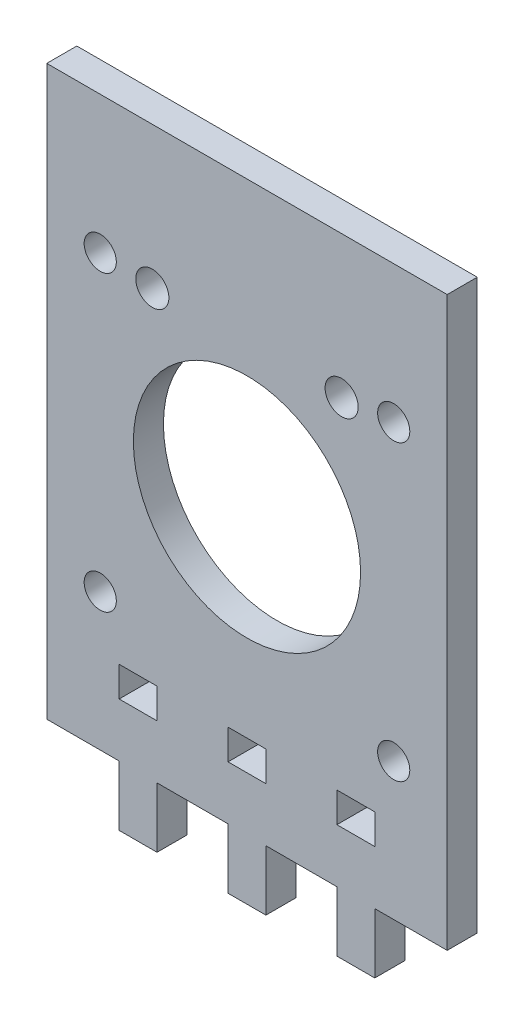
ISO-10303-21;
HEADER;
FILE_DESCRIPTION(('STEP AP214'),'2;1');
FILE_NAME('part.step','',(''),(''),'','','');
FILE_SCHEMA(('AUTOMOTIVE_DESIGN { 1 0 10303 214 1 1 1 1 }'));
ENDSEC;
DATA;
#1=APPLICATION_CONTEXT('core data for automotive mechanical design processes');
#2=APPLICATION_PROTOCOL_DEFINITION('international standard','automotive_design',2000,#1);
#3=PRODUCT_CONTEXT('',#1,'mechanical');
#4=PRODUCT('Part','Part','',(#3));
#5=PRODUCT_RELATED_PRODUCT_CATEGORY('part','',(#4));
#6=PRODUCT_DEFINITION_FORMATION('','',#4);
#7=PRODUCT_DEFINITION_CONTEXT('part definition',#1,'design');
#8=PRODUCT_DEFINITION('design','',#6,#7);
#9=PRODUCT_DEFINITION_SHAPE('','',#8);
#10=(LENGTH_UNIT() NAMED_UNIT(*) SI_UNIT(.MILLI.,.METRE.));
#11=(NAMED_UNIT(*) PLANE_ANGLE_UNIT() SI_UNIT($,.RADIAN.));
#12=(NAMED_UNIT(*) SI_UNIT($,.STERADIAN.) SOLID_ANGLE_UNIT());
#13=UNCERTAINTY_MEASURE_WITH_UNIT(LENGTH_MEASURE(1.E-05),#10,'distance_accuracy_value','');
#14=(GEOMETRIC_REPRESENTATION_CONTEXT(3) GLOBAL_UNCERTAINTY_ASSIGNED_CONTEXT((#13)) GLOBAL_UNIT_ASSIGNED_CONTEXT((#10,
#11,#12)) REPRESENTATION_CONTEXT('',''));
#15=CARTESIAN_POINT('',(0.,0.,0.));
#16=DIRECTION('',(0.,0.,1.));
#17=DIRECTION('',(1.,0.,0.));
#18=AXIS2_PLACEMENT_3D('',#15,#16,#17);
#19=CARTESIAN_POINT('',(13.4999999999999,0.,3.175));
#20=DIRECTION('',(-1.,0.,0.));
#21=DIRECTION('',(0.,0.,1.));
#22=AXIS2_PLACEMENT_3D('',#19,#20,#21);
#23=PLANE('',#22);
#24=DIRECTION('',(0.,1.,0.));
#25=VECTOR('',#24,1.);
#26=CARTESIAN_POINT('',(13.4999999999999,0.,0.));
#27=LINE('',#26,#25);
#28=CARTESIAN_POINT('',(13.4999999999999,-24.325,0.));
#29=VERTEX_POINT('',#28);
#30=CARTESIAN_POINT('',(13.4999999999999,-21.15,0.));
#31=VERTEX_POINT('',#30);
#32=EDGE_CURVE('E306',#29,#31,#27,.T.);
#33=ORIENTED_EDGE('',*,*,#32,.F.);
#34=DIRECTION('',(0.,0.,-1.));
#35=VECTOR('',#34,1.);
#36=CARTESIAN_POINT('',(13.4999999999999,-24.325,3.175));
#37=LINE('',#36,#35);
#38=CARTESIAN_POINT('',(13.4999999999999,-24.325,3.175));
#39=VERTEX_POINT('',#38);
#40=EDGE_CURVE('E11',#39,#29,#37,.T.);
#41=ORIENTED_EDGE('',*,*,#40,.F.);
#42=DIRECTION('',(0.,1.,0.));
#43=VECTOR('',#42,1.);
#44=CARTESIAN_POINT('',(13.4999999999999,0.,3.175));
#45=LINE('',#44,#43);
#46=CARTESIAN_POINT('',(13.4999999999999,-21.15,3.175));
#47=VERTEX_POINT('',#46);
#48=EDGE_CURVE('E220',#39,#47,#45,.T.);
#49=ORIENTED_EDGE('',*,*,#48,.T.);
#50=DIRECTION('',(0.,0.,-1.));
#51=VECTOR('',#50,1.);
#52=CARTESIAN_POINT('',(13.4999999999999,-21.15,3.175));
#53=LINE('',#52,#51);
#54=EDGE_CURVE('E136',#47,#31,#53,.T.);
#55=ORIENTED_EDGE('',*,*,#54,.T.);
#56=EDGE_LOOP('',(#33,#41,#49,#55));
#57=FACE_BOUND('',#56,.T.);
#58=ADVANCED_FACE('F39',(#57),#23,.T.);
#59=CARTESIAN_POINT('',(0.,-24.325,3.175));
#60=DIRECTION('',(0.,1.,0.));
#61=DIRECTION('',(-1.,0.,0.));
#62=AXIS2_PLACEMENT_3D('',#59,#60,#61);
#63=PLANE('',#62);
#64=DIRECTION('',(1.,0.,0.));
#65=VECTOR('',#64,1.);
#66=CARTESIAN_POINT('',(0.,-24.325,0.));
#67=LINE('',#66,#65);
#68=CARTESIAN_POINT('',(9.49999999999998,-24.325,0.));
#69=VERTEX_POINT('',#68);
#70=EDGE_CURVE('E209',#69,#29,#67,.T.);
#71=ORIENTED_EDGE('',*,*,#70,.F.);
#72=DIRECTION('',(0.,0.,-1.));
#73=VECTOR('',#72,1.);
#74=CARTESIAN_POINT('',(9.49999999999998,-24.325,3.175));
#75=LINE('',#74,#73);
#76=CARTESIAN_POINT('',(9.49999999999998,-24.325,3.175));
#77=VERTEX_POINT('',#76);
#78=EDGE_CURVE('E49',#77,#69,#75,.T.);
#79=ORIENTED_EDGE('',*,*,#78,.F.);
#80=DIRECTION('',(1.,0.,0.));
#81=VECTOR('',#80,1.);
#82=CARTESIAN_POINT('',(0.,-24.325,3.175));
#83=LINE('',#82,#81);
#84=EDGE_CURVE('E207',#77,#39,#83,.T.);
#85=ORIENTED_EDGE('',*,*,#84,.T.);
#86=ORIENTED_EDGE('',*,*,#40,.T.);
#87=EDGE_LOOP('',(#71,#79,#85,#86));
#88=FACE_BOUND('',#87,.T.);
#89=ADVANCED_FACE('F205',(#88),#63,.T.);
#90=CARTESIAN_POINT('',(9.49999999999994,0.,3.175));
#91=DIRECTION('',(-1.,0.,0.));
#92=DIRECTION('',(0.,0.,1.));
#93=AXIS2_PLACEMENT_3D('',#90,#91,#92);
#94=PLANE('',#93);
#95=DIRECTION('',(0.,1.,0.));
#96=VECTOR('',#95,1.);
#97=CARTESIAN_POINT('',(9.49999999999994,0.,0.));
#98=LINE('',#97,#96);
#99=CARTESIAN_POINT('',(9.49999999999994,-21.15,0.));
#100=VERTEX_POINT('',#99);
#101=EDGE_CURVE('E309',#69,#100,#98,.T.);
#102=ORIENTED_EDGE('',*,*,#101,.T.);
#103=DIRECTION('',(0.,0.,-1.));
#104=VECTOR('',#103,1.);
#105=CARTESIAN_POINT('',(9.49999999999994,-21.15,3.175));
#106=LINE('',#105,#104);
#107=CARTESIAN_POINT('',(9.49999999999994,-21.15,3.175));
#108=VERTEX_POINT('',#107);
#109=EDGE_CURVE('E212',#108,#100,#106,.T.);
#110=ORIENTED_EDGE('',*,*,#109,.F.);
#111=DIRECTION('',(0.,1.,0.));
#112=VECTOR('',#111,1.);
#113=CARTESIAN_POINT('',(9.49999999999994,0.,3.175));
#114=LINE('',#113,#112);
#115=EDGE_CURVE('E215',#77,#108,#114,.T.);
#116=ORIENTED_EDGE('',*,*,#115,.F.);
#117=ORIENTED_EDGE('',*,*,#78,.T.);
#118=EDGE_LOOP('',(#102,#110,#116,#117));
#119=FACE_BOUND('',#118,.T.);
#120=ADVANCED_FACE('F216',(#119),#94,.F.);
#121=CARTESIAN_POINT('',(1.99999999999994,0.,3.175));
#122=DIRECTION('',(-1.,0.,0.));
#123=DIRECTION('',(0.,0.,1.));
#124=AXIS2_PLACEMENT_3D('',#121,#122,#123);
#125=PLANE('',#124);
#126=DIRECTION('',(0.,1.,0.));
#127=VECTOR('',#126,1.);
#128=CARTESIAN_POINT('',(1.99999999999994,0.,0.));
#129=LINE('',#128,#127);
#130=CARTESIAN_POINT('',(1.9999999999999,-24.325,0.));
#131=VERTEX_POINT('',#130);
#132=CARTESIAN_POINT('',(1.99999999999994,-21.15,0.));
#133=VERTEX_POINT('',#132);
#134=EDGE_CURVE('E294',#131,#133,#129,.T.);
#135=ORIENTED_EDGE('',*,*,#134,.F.);
#136=DIRECTION('',(0.,0.,-1.));
#137=VECTOR('',#136,1.);
#138=CARTESIAN_POINT('',(1.9999999999999,-24.325,3.175));
#139=LINE('',#138,#137);
#140=CARTESIAN_POINT('',(1.9999999999999,-24.325,3.175));
#141=VERTEX_POINT('',#140);
#142=EDGE_CURVE('E335',#141,#131,#139,.T.);
#143=ORIENTED_EDGE('',*,*,#142,.F.);
#144=DIRECTION('',(0.,1.,0.));
#145=VECTOR('',#144,1.);
#146=CARTESIAN_POINT('',(1.99999999999994,0.,3.175));
#147=LINE('',#146,#145);
#148=CARTESIAN_POINT('',(1.99999999999994,-21.15,3.175));
#149=VERTEX_POINT('',#148);
#150=EDGE_CURVE('E469',#141,#149,#147,.T.);
#151=ORIENTED_EDGE('',*,*,#150,.T.);
#152=DIRECTION('',(0.,0.,-1.));
#153=VECTOR('',#152,1.);
#154=CARTESIAN_POINT('',(1.99999999999994,-21.15,3.175));
#155=LINE('',#154,#153);
#156=EDGE_CURVE('E337',#149,#133,#155,.T.);
#157=ORIENTED_EDGE('',*,*,#156,.T.);
#158=EDGE_LOOP('',(#135,#143,#151,#157));
#159=FACE_BOUND('',#158,.T.);
#160=ADVANCED_FACE('F487',(#159),#125,.T.);
#161=CARTESIAN_POINT('',(0.,-24.325,3.175));
#162=DIRECTION('',(0.,1.,0.));
#163=DIRECTION('',(0.,0.,1.));
#164=AXIS2_PLACEMENT_3D('',#161,#162,#163);
#165=PLANE('',#164);
#166=DIRECTION('',(1.,0.,0.));
#167=VECTOR('',#166,1.);
#168=CARTESIAN_POINT('',(0.,-24.325,0.));
#169=LINE('',#168,#167);
#170=CARTESIAN_POINT('',(-2.0000000000001,-24.325,0.));
#171=VERTEX_POINT('',#170);
#172=EDGE_CURVE('E297',#171,#131,#169,.T.);
#173=ORIENTED_EDGE('',*,*,#172,.F.);
#174=DIRECTION('',(0.,0.,-1.));
#175=VECTOR('',#174,1.);
#176=CARTESIAN_POINT('',(-2.0000000000001,-24.325,3.175));
#177=LINE('',#176,#175);
#178=CARTESIAN_POINT('',(-2.0000000000001,-24.325,3.175));
#179=VERTEX_POINT('',#178);
#180=EDGE_CURVE('E343',#179,#171,#177,.T.);
#181=ORIENTED_EDGE('',*,*,#180,.F.);
#182=DIRECTION('',(1.,0.,0.));
#183=VECTOR('',#182,1.);
#184=CARTESIAN_POINT('',(0.,-24.325,3.175));
#185=LINE('',#184,#183);
#186=EDGE_CURVE('E472',#179,#141,#185,.T.);
#187=ORIENTED_EDGE('',*,*,#186,.T.);
#188=ORIENTED_EDGE('',*,*,#142,.T.);
#189=EDGE_LOOP('',(#173,#181,#187,#188));
#190=FACE_BOUND('',#189,.T.);
#191=ADVANCED_FACE('F490',(#190),#165,.T.);
#192=CARTESIAN_POINT('',(-2.00000000000006,0.,3.175));
#193=DIRECTION('',(-1.,0.,0.));
#194=DIRECTION('',(0.,0.,1.));
#195=AXIS2_PLACEMENT_3D('',#192,#193,#194);
#196=PLANE('',#195);
#197=DIRECTION('',(0.,1.,0.));
#198=VECTOR('',#197,1.);
#199=CARTESIAN_POINT('',(-2.00000000000006,0.,0.));
#200=LINE('',#199,#198);
#201=CARTESIAN_POINT('',(-2.00000000000006,-21.15,0.));
#202=VERTEX_POINT('',#201);
#203=EDGE_CURVE('E300',#171,#202,#200,.T.);
#204=ORIENTED_EDGE('',*,*,#203,.T.);
#205=DIRECTION('',(0.,0.,-1.));
#206=VECTOR('',#205,1.);
#207=CARTESIAN_POINT('',(-2.00000000000006,-21.15,3.175));
#208=LINE('',#207,#206);
#209=CARTESIAN_POINT('',(-2.00000000000006,-21.15,3.175));
#210=VERTEX_POINT('',#209);
#211=EDGE_CURVE('E339',#210,#202,#208,.T.);
#212=ORIENTED_EDGE('',*,*,#211,.F.);
#213=DIRECTION('',(0.,1.,0.));
#214=VECTOR('',#213,1.);
#215=CARTESIAN_POINT('',(-2.00000000000006,0.,3.175));
#216=LINE('',#215,#214);
#217=EDGE_CURVE('E475',#179,#210,#216,.T.);
#218=ORIENTED_EDGE('',*,*,#217,.F.);
#219=ORIENTED_EDGE('',*,*,#180,.T.);
#220=EDGE_LOOP('',(#204,#212,#218,#219));
#221=FACE_BOUND('',#220,.T.);
#222=ADVANCED_FACE('F493',(#221),#196,.F.);
#223=CARTESIAN_POINT('',(-9.50000000000006,0.,3.175));
#224=DIRECTION('',(-1.,0.,0.));
#225=DIRECTION('',(0.,0.,1.));
#226=AXIS2_PLACEMENT_3D('',#223,#224,#225);
#227=PLANE('',#226);
#228=DIRECTION('',(0.,1.,0.));
#229=VECTOR('',#228,1.);
#230=CARTESIAN_POINT('',(-9.50000000000006,0.,0.));
#231=LINE('',#230,#229);
#232=CARTESIAN_POINT('',(-9.50000000000006,-24.325,0.));
#233=VERTEX_POINT('',#232);
#234=CARTESIAN_POINT('',(-9.50000000000006,-21.15,0.));
#235=VERTEX_POINT('',#234);
#236=EDGE_CURVE('E282',#233,#235,#231,.T.);
#237=ORIENTED_EDGE('',*,*,#236,.F.);
#238=DIRECTION('',(0.,0.,-1.));
#239=VECTOR('',#238,1.);
#240=CARTESIAN_POINT('',(-9.50000000000006,-24.325,3.175));
#241=LINE('',#240,#239);
#242=CARTESIAN_POINT('',(-9.50000000000006,-24.325,3.175));
#243=VERTEX_POINT('',#242);
#244=EDGE_CURVE('E340',#243,#233,#241,.T.);
#245=ORIENTED_EDGE('',*,*,#244,.F.);
#246=DIRECTION('',(0.,1.,0.));
#247=VECTOR('',#246,1.);
#248=CARTESIAN_POINT('',(-9.50000000000006,0.,3.175));
#249=LINE('',#248,#247);
#250=CARTESIAN_POINT('',(-9.50000000000006,-21.15,3.175));
#251=VERTEX_POINT('',#250);
#252=EDGE_CURVE('E458',#243,#251,#249,.T.);
#253=ORIENTED_EDGE('',*,*,#252,.T.);
#254=DIRECTION('',(0.,0.,-1.));
#255=VECTOR('',#254,1.);
#256=CARTESIAN_POINT('',(-9.50000000000006,-21.15,3.175));
#257=LINE('',#256,#255);
#258=EDGE_CURVE('E346',#251,#235,#257,.T.);
#259=ORIENTED_EDGE('',*,*,#258,.T.);
#260=EDGE_LOOP('',(#237,#245,#253,#259));
#261=FACE_BOUND('',#260,.T.);
#262=ADVANCED_FACE('F542',(#261),#227,.T.);
#263=CARTESIAN_POINT('',(0.,-24.325,3.175));
#264=DIRECTION('',(0.,1.,0.));
#265=DIRECTION('',(0.,0.,1.));
#266=AXIS2_PLACEMENT_3D('',#263,#264,#265);
#267=PLANE('',#266);
#268=DIRECTION('',(1.,0.,0.));
#269=VECTOR('',#268,1.);
#270=CARTESIAN_POINT('',(0.,-24.325,0.));
#271=LINE('',#270,#269);
#272=CARTESIAN_POINT('',(-13.5000000000001,-24.325,0.));
#273=VERTEX_POINT('',#272);
#274=EDGE_CURVE('E285',#273,#233,#271,.T.);
#275=ORIENTED_EDGE('',*,*,#274,.F.);
#276=DIRECTION('',(0.,0.,-1.));
#277=VECTOR('',#276,1.);
#278=CARTESIAN_POINT('',(-13.5000000000001,-24.325,3.175));
#279=LINE('',#278,#277);
#280=CARTESIAN_POINT('',(-13.5000000000001,-24.325,3.175));
#281=VERTEX_POINT('',#280);
#282=EDGE_CURVE('E351',#281,#273,#279,.T.);
#283=ORIENTED_EDGE('',*,*,#282,.F.);
#284=DIRECTION('',(1.,0.,0.));
#285=VECTOR('',#284,1.);
#286=CARTESIAN_POINT('',(0.,-24.325,3.175));
#287=LINE('',#286,#285);
#288=EDGE_CURVE('E461',#281,#243,#287,.T.);
#289=ORIENTED_EDGE('',*,*,#288,.T.);
#290=ORIENTED_EDGE('',*,*,#244,.T.);
#291=EDGE_LOOP('',(#275,#283,#289,#290));
#292=FACE_BOUND('',#291,.T.);
#293=ADVANCED_FACE('F553',(#292),#267,.T.);
#294=CARTESIAN_POINT('',(-13.5000000000001,0.,3.175));
#295=DIRECTION('',(-1.,0.,0.));
#296=DIRECTION('',(0.,0.,1.));
#297=AXIS2_PLACEMENT_3D('',#294,#295,#296);
#298=PLANE('',#297);
#299=DIRECTION('',(0.,1.,0.));
#300=VECTOR('',#299,1.);
#301=CARTESIAN_POINT('',(-13.5000000000001,0.,0.));
#302=LINE('',#301,#300);
#303=CARTESIAN_POINT('',(-13.5000000000001,-21.15,0.));
#304=VERTEX_POINT('',#303);
#305=EDGE_CURVE('E288',#273,#304,#302,.T.);
#306=ORIENTED_EDGE('',*,*,#305,.T.);
#307=DIRECTION('',(0.,0.,-1.));
#308=VECTOR('',#307,1.);
#309=CARTESIAN_POINT('',(-13.5000000000001,-21.15,3.175));
#310=LINE('',#309,#308);
#311=CARTESIAN_POINT('',(-13.5000000000001,-21.15,3.175));
#312=VERTEX_POINT('',#311);
#313=EDGE_CURVE('E348',#312,#304,#310,.T.);
#314=ORIENTED_EDGE('',*,*,#313,.F.);
#315=DIRECTION('',(0.,1.,0.));
#316=VECTOR('',#315,1.);
#317=CARTESIAN_POINT('',(-13.5000000000001,0.,3.175));
#318=LINE('',#317,#316);
#319=EDGE_CURVE('E464',#281,#312,#318,.T.);
#320=ORIENTED_EDGE('',*,*,#319,.F.);
#321=ORIENTED_EDGE('',*,*,#282,.T.);
#322=EDGE_LOOP('',(#306,#314,#320,#321));
#323=FACE_BOUND('',#322,.T.);
#324=ADVANCED_FACE('F550',(#323),#298,.F.);
#325=CARTESIAN_POINT('',(-21.15,0.,3.175));
#326=DIRECTION('',(-1.,0.,0.));
#327=DIRECTION('',(0.,0.,1.));
#328=AXIS2_PLACEMENT_3D('',#325,#326,#327);
#329=PLANE('',#328);
#330=DIRECTION('',(0.,1.,0.));
#331=VECTOR('',#330,1.);
#332=CARTESIAN_POINT('',(-21.15,0.,0.));
#333=LINE('',#332,#331);
#334=CARTESIAN_POINT('',(-21.15,-30.,0.));
#335=VERTEX_POINT('',#334);
#336=CARTESIAN_POINT('',(-21.15,30.,0.));
#337=VERTEX_POINT('',#336);
#338=EDGE_CURVE('E249',#335,#337,#333,.T.);
#339=ORIENTED_EDGE('',*,*,#338,.F.);
#340=DIRECTION('',(0.,0.,-1.));
#341=VECTOR('',#340,1.);
#342=CARTESIAN_POINT('',(-21.15,-30.,3.175));
#343=LINE('',#342,#341);
#344=CARTESIAN_POINT('',(-21.15,-30.,3.175));
#345=VERTEX_POINT('',#344);
#346=EDGE_CURVE('E43',#345,#335,#343,.T.);
#347=ORIENTED_EDGE('',*,*,#346,.F.);
#348=DIRECTION('',(0.,1.,0.));
#349=VECTOR('',#348,1.);
#350=CARTESIAN_POINT('',(-21.15,0.,3.175));
#351=LINE('',#350,#349);
#352=CARTESIAN_POINT('',(-21.15,30.,3.175));
#353=VERTEX_POINT('',#352);
#354=EDGE_CURVE('E333',#345,#353,#351,.T.);
#355=ORIENTED_EDGE('',*,*,#354,.T.);
#356=DIRECTION('',(0.,0.,-1.));
#357=VECTOR('',#356,1.);
#358=CARTESIAN_POINT('',(-21.15,30.,3.175));
#359=LINE('',#358,#357);
#360=EDGE_CURVE('E248',#353,#337,#359,.T.);
#361=ORIENTED_EDGE('',*,*,#360,.T.);
#362=EDGE_LOOP('',(#339,#347,#355,#361));
#363=FACE_BOUND('',#362,.T.);
#364=ADVANCED_FACE('F41',(#363),#329,.T.);
#365=CARTESIAN_POINT('',(0.,-30.,3.175));
#366=DIRECTION('',(0.,-1.,0.));
#367=DIRECTION('',(1.,0.,0.));
#368=AXIS2_PLACEMENT_3D('',#365,#366,#367);
#369=PLANE('',#368);
#370=DIRECTION('',(-1.,0.,0.));
#371=VECTOR('',#370,1.);
#372=CARTESIAN_POINT('',(0.,-30.,0.));
#373=LINE('',#372,#371);
#374=CARTESIAN_POINT('',(-13.5000000000001,-30.,0.));
#375=VERTEX_POINT('',#374);
#376=EDGE_CURVE('E252',#375,#335,#373,.T.);
#377=ORIENTED_EDGE('',*,*,#376,.F.);
#378=DIRECTION('',(0.,0.,-1.));
#379=VECTOR('',#378,1.);
#380=CARTESIAN_POINT('',(-13.5000000000001,-30.,3.175));
#381=LINE('',#380,#379);
#382=CARTESIAN_POINT('',(-13.5000000000001,-30.,3.175));
#383=VERTEX_POINT('',#382);
#384=EDGE_CURVE('E369',#383,#375,#381,.T.);
#385=ORIENTED_EDGE('',*,*,#384,.F.);
#386=DIRECTION('',(-1.,0.,0.));
#387=VECTOR('',#386,1.);
#388=CARTESIAN_POINT('',(0.,-30.,3.175));
#389=LINE('',#388,#387);
#390=EDGE_CURVE('E378',#383,#345,#389,.T.);
#391=ORIENTED_EDGE('',*,*,#390,.T.);
#392=ORIENTED_EDGE('',*,*,#346,.T.);
#393=EDGE_LOOP('',(#377,#385,#391,#392));
#394=FACE_BOUND('',#393,.T.);
#395=ADVANCED_FACE('F376',(#394),#369,.T.);
#396=CARTESIAN_POINT('',(-13.5000000000001,0.,3.175));
#397=DIRECTION('',(1.,0.,0.));
#398=DIRECTION('',(0.,0.,-1.));
#399=AXIS2_PLACEMENT_3D('',#396,#397,#398);
#400=PLANE('',#399);
#401=DIRECTION('',(0.,-1.,0.));
#402=VECTOR('',#401,1.);
#403=CARTESIAN_POINT('',(-13.5000000000001,0.,0.));
#404=LINE('',#403,#402);
#405=CARTESIAN_POINT('',(-13.5,-36.35,0.));
#406=VERTEX_POINT('',#405);
#407=EDGE_CURVE('E256',#375,#406,#404,.T.);
#408=ORIENTED_EDGE('',*,*,#407,.T.);
#409=DIRECTION('',(0.,0.,1.));
#410=VECTOR('',#409,1.);
#411=CARTESIAN_POINT('',(-13.5,-36.35,0.));
#412=LINE('',#411,#410);
#413=CARTESIAN_POINT('',(-13.5,-36.35,3.175));
#414=VERTEX_POINT('',#413);
#415=EDGE_CURVE('E392',#406,#414,#412,.T.);
#416=ORIENTED_EDGE('',*,*,#415,.T.);
#417=DIRECTION('',(0.,-1.,0.));
#418=VECTOR('',#417,1.);
#419=CARTESIAN_POINT('',(-13.5000000000001,0.,3.175));
#420=LINE('',#419,#418);
#421=EDGE_CURVE('E433',#383,#414,#420,.T.);
#422=ORIENTED_EDGE('',*,*,#421,.F.);
#423=ORIENTED_EDGE('',*,*,#384,.T.);
#424=EDGE_LOOP('',(#408,#416,#422,#423));
#425=FACE_BOUND('',#424,.T.);
#426=ADVANCED_FACE('F390',(#425),#400,.F.);
#427=CARTESIAN_POINT('',(-9.50000000000006,0.,3.175));
#428=DIRECTION('',(1.,0.,0.));
#429=DIRECTION('',(0.,0.,-1.));
#430=AXIS2_PLACEMENT_3D('',#427,#428,#429);
#431=PLANE('',#430);
#432=DIRECTION('',(0.,-1.,0.));
#433=VECTOR('',#432,1.);
#434=CARTESIAN_POINT('',(-9.50000000000006,0.,0.));
#435=LINE('',#434,#433);
#436=CARTESIAN_POINT('',(-9.50000000000006,-30.,0.));
#437=VERTEX_POINT('',#436);
#438=CARTESIAN_POINT('',(-9.50000000000003,-36.35,0.));
#439=VERTEX_POINT('',#438);
#440=EDGE_CURVE('E261',#437,#439,#435,.T.);
#441=ORIENTED_EDGE('',*,*,#440,.F.);
#442=DIRECTION('',(0.,0.,-1.));
#443=VECTOR('',#442,1.);
#444=CARTESIAN_POINT('',(-9.50000000000006,-30.,3.175));
#445=LINE('',#444,#443);
#446=CARTESIAN_POINT('',(-9.50000000000006,-30.,3.175));
#447=VERTEX_POINT('',#446);
#448=EDGE_CURVE('E368',#447,#437,#445,.T.);
#449=ORIENTED_EDGE('',*,*,#448,.F.);
#450=DIRECTION('',(0.,-1.,0.));
#451=VECTOR('',#450,1.);
#452=CARTESIAN_POINT('',(-9.50000000000006,0.,3.175));
#453=LINE('',#452,#451);
#454=CARTESIAN_POINT('',(-9.50000000000003,-36.35,3.175));
#455=VERTEX_POINT('',#454);
#456=EDGE_CURVE('E438',#447,#455,#453,.T.);
#457=ORIENTED_EDGE('',*,*,#456,.T.);
#458=DIRECTION('',(0.,0.,1.));
#459=VECTOR('',#458,1.);
#460=CARTESIAN_POINT('',(-9.50000000000003,-36.35,0.));
#461=LINE('',#460,#459);
#462=EDGE_CURVE('E402',#439,#455,#461,.T.);
#463=ORIENTED_EDGE('',*,*,#462,.F.);
#464=EDGE_LOOP('',(#441,#449,#457,#463));
#465=FACE_BOUND('',#464,.T.);
#466=ADVANCED_FACE('F588',(#465),#431,.T.);
#467=CARTESIAN_POINT('',(-2.0000000000001,-30.,0.));
#468=VERTEX_POINT('',#467);
#469=EDGE_CURVE('E258',#468,#437,#373,.T.);
#470=ORIENTED_EDGE('',*,*,#469,.F.);
#471=DIRECTION('',(0.,0.,-1.));
#472=VECTOR('',#471,1.);
#473=CARTESIAN_POINT('',(-2.0000000000001,-30.,3.175));
#474=LINE('',#473,#472);
#475=CARTESIAN_POINT('',(-2.0000000000001,-30.,3.175));
#476=VERTEX_POINT('',#475);
#477=EDGE_CURVE('E366',#476,#468,#474,.T.);
#478=ORIENTED_EDGE('',*,*,#477,.F.);
#479=EDGE_CURVE('E435',#476,#447,#389,.T.);
#480=ORIENTED_EDGE('',*,*,#479,.T.);
#481=ORIENTED_EDGE('',*,*,#448,.T.);
#482=EDGE_LOOP('',(#470,#478,#480,#481));
#483=FACE_BOUND('',#482,.T.);
#484=ADVANCED_FACE('F586',(#483),#369,.T.);
#485=CARTESIAN_POINT('',(-2.0000000000001,0.,3.175));
#486=DIRECTION('',(1.,0.,0.));
#487=DIRECTION('',(0.,1.,0.));
#488=AXIS2_PLACEMENT_3D('',#485,#486,#487);
#489=PLANE('',#488);
#490=DIRECTION('',(0.,-1.,0.));
#491=VECTOR('',#490,1.);
#492=CARTESIAN_POINT('',(-2.0000000000001,0.,0.));
#493=LINE('',#492,#491);
#494=CARTESIAN_POINT('',(-2.00000000000003,-36.3500000000002,0.));
#495=VERTEX_POINT('',#494);
#496=EDGE_CURVE('E264',#468,#495,#493,.T.);
#497=ORIENTED_EDGE('',*,*,#496,.T.);
#498=DIRECTION('',(0.,0.,1.));
#499=VECTOR('',#498,1.);
#500=CARTESIAN_POINT('',(-2.00000000000003,-36.3500000000002,0.));
#501=LINE('',#500,#499);
#502=CARTESIAN_POINT('',(-2.00000000000003,-36.3500000000002,3.175));
#503=VERTEX_POINT('',#502);
#504=EDGE_CURVE('E412',#495,#503,#501,.T.);
#505=ORIENTED_EDGE('',*,*,#504,.T.);
#506=DIRECTION('',(0.,-1.,0.));
#507=VECTOR('',#506,1.);
#508=CARTESIAN_POINT('',(-2.0000000000001,0.,3.175));
#509=LINE('',#508,#507);
#510=EDGE_CURVE('E441',#476,#503,#509,.T.);
#511=ORIENTED_EDGE('',*,*,#510,.F.);
#512=ORIENTED_EDGE('',*,*,#477,.T.);
#513=EDGE_LOOP('',(#497,#505,#511,#512));
#514=FACE_BOUND('',#513,.T.);
#515=ADVANCED_FACE('F582',(#514),#489,.F.);
#516=CARTESIAN_POINT('',(1.9999999999999,0.,3.175));
#517=DIRECTION('',(1.,0.,0.));
#518=DIRECTION('',(0.,1.,0.));
#519=AXIS2_PLACEMENT_3D('',#516,#517,#518);
#520=PLANE('',#519);
#521=DIRECTION('',(0.,-1.,0.));
#522=VECTOR('',#521,1.);
#523=CARTESIAN_POINT('',(1.9999999999999,0.,0.));
#524=LINE('',#523,#522);
#525=CARTESIAN_POINT('',(1.9999999999999,-30.,0.));
#526=VERTEX_POINT('',#525);
#527=CARTESIAN_POINT('',(1.99999999999997,-36.3500000000002,0.));
#528=VERTEX_POINT('',#527);
#529=EDGE_CURVE('E267',#526,#528,#524,.T.);
#530=ORIENTED_EDGE('',*,*,#529,.F.);
#531=DIRECTION('',(0.,0.,-1.));
#532=VECTOR('',#531,1.);
#533=CARTESIAN_POINT('',(1.9999999999999,-30.,3.175));
#534=LINE('',#533,#532);
#535=CARTESIAN_POINT('',(1.9999999999999,-30.,3.175));
#536=VERTEX_POINT('',#535);
#537=EDGE_CURVE('E364',#536,#526,#534,.T.);
#538=ORIENTED_EDGE('',*,*,#537,.F.);
#539=DIRECTION('',(0.,-1.,0.));
#540=VECTOR('',#539,1.);
#541=CARTESIAN_POINT('',(1.9999999999999,0.,3.175));
#542=LINE('',#541,#540);
#543=CARTESIAN_POINT('',(1.99999999999997,-36.3500000000002,3.175));
#544=VERTEX_POINT('',#543);
#545=EDGE_CURVE('E444',#536,#544,#542,.T.);
#546=ORIENTED_EDGE('',*,*,#545,.T.);
#547=DIRECTION('',(0.,0.,1.));
#548=VECTOR('',#547,1.);
#549=CARTESIAN_POINT('',(1.99999999999997,-36.3500000000002,0.));
#550=LINE('',#549,#548);
#551=EDGE_CURVE('E415',#528,#544,#550,.T.);
#552=ORIENTED_EDGE('',*,*,#551,.F.);
#553=EDGE_LOOP('',(#530,#538,#546,#552));
#554=FACE_BOUND('',#553,.T.);
#555=ADVANCED_FACE('F579',(#554),#520,.T.);
#556=CARTESIAN_POINT('',(9.49999999999998,-30.,0.));
#557=VERTEX_POINT('',#556);
#558=EDGE_CURVE('E270',#557,#526,#373,.T.);
#559=ORIENTED_EDGE('',*,*,#558,.F.);
#560=DIRECTION('',(0.,0.,-1.));
#561=VECTOR('',#560,1.);
#562=CARTESIAN_POINT('',(9.49999999999998,-30.,3.175));
#563=LINE('',#562,#561);
#564=CARTESIAN_POINT('',(9.49999999999998,-30.,3.175));
#565=VERTEX_POINT('',#564);
#566=EDGE_CURVE('E362',#565,#557,#563,.T.);
#567=ORIENTED_EDGE('',*,*,#566,.F.);
#568=EDGE_CURVE('E447',#565,#536,#389,.T.);
#569=ORIENTED_EDGE('',*,*,#568,.T.);
#570=ORIENTED_EDGE('',*,*,#537,.T.);
#571=EDGE_LOOP('',(#559,#567,#569,#570));
#572=FACE_BOUND('',#571,.T.);
#573=ADVANCED_FACE('F571',(#572),#369,.T.);
#574=CARTESIAN_POINT('',(9.49999999999998,0.,3.175));
#575=DIRECTION('',(1.,0.,0.));
#576=DIRECTION('',(0.,0.,-1.));
#577=AXIS2_PLACEMENT_3D('',#574,#575,#576);
#578=PLANE('',#577);
#579=DIRECTION('',(0.,-1.,0.));
#580=VECTOR('',#579,1.);
#581=CARTESIAN_POINT('',(9.49999999999998,0.,0.));
#582=LINE('',#581,#580);
#583=CARTESIAN_POINT('',(9.49999999999997,-36.3500000000003,0.));
#584=VERTEX_POINT('',#583);
#585=EDGE_CURVE('E271',#557,#584,#582,.T.);
#586=ORIENTED_EDGE('',*,*,#585,.T.);
#587=DIRECTION('',(0.,0.,1.));
#588=VECTOR('',#587,1.);
#589=CARTESIAN_POINT('',(9.49999999999997,-36.3500000000003,0.));
#590=LINE('',#589,#588);
#591=CARTESIAN_POINT('',(9.49999999999997,-36.3500000000003,3.175));
#592=VERTEX_POINT('',#591);
#593=EDGE_CURVE('E424',#584,#592,#590,.T.);
#594=ORIENTED_EDGE('',*,*,#593,.T.);
#595=DIRECTION('',(0.,-1.,0.));
#596=VECTOR('',#595,1.);
#597=CARTESIAN_POINT('',(9.49999999999998,0.,3.175));
#598=LINE('',#597,#596);
#599=EDGE_CURVE('E448',#565,#592,#598,.T.);
#600=ORIENTED_EDGE('',*,*,#599,.F.);
#601=ORIENTED_EDGE('',*,*,#566,.T.);
#602=EDGE_LOOP('',(#586,#594,#600,#601));
#603=FACE_BOUND('',#602,.T.);
#604=ADVANCED_FACE('F574',(#603),#578,.F.);
#605=CARTESIAN_POINT('',(13.4999999999999,0.,3.175));
#606=DIRECTION('',(1.,0.,0.));
#607=DIRECTION('',(0.,0.,-1.));
#608=AXIS2_PLACEMENT_3D('',#605,#606,#607);
#609=PLANE('',#608);
#610=DIRECTION('',(0.,-1.,0.));
#611=VECTOR('',#610,1.);
#612=CARTESIAN_POINT('',(13.4999999999999,0.,0.));
#613=LINE('',#612,#611);
#614=CARTESIAN_POINT('',(13.4999999999999,-30.,0.));
#615=VERTEX_POINT('',#614);
#616=CARTESIAN_POINT('',(13.5,-36.3500000000003,0.));
#617=VERTEX_POINT('',#616);
#618=EDGE_CURVE('E274',#615,#617,#613,.T.);
#619=ORIENTED_EDGE('',*,*,#618,.F.);
#620=DIRECTION('',(0.,0.,-1.));
#621=VECTOR('',#620,1.);
#622=CARTESIAN_POINT('',(13.4999999999999,-30.,3.175));
#623=LINE('',#622,#621);
#624=CARTESIAN_POINT('',(13.4999999999999,-30.,3.175));
#625=VERTEX_POINT('',#624);
#626=EDGE_CURVE('E360',#625,#615,#623,.T.);
#627=ORIENTED_EDGE('',*,*,#626,.F.);
#628=DIRECTION('',(0.,-1.,0.));
#629=VECTOR('',#628,1.);
#630=CARTESIAN_POINT('',(13.4999999999999,0.,3.175));
#631=LINE('',#630,#629);
#632=CARTESIAN_POINT('',(13.5,-36.3500000000003,3.175));
#633=VERTEX_POINT('',#632);
#634=EDGE_CURVE('E451',#625,#633,#631,.T.);
#635=ORIENTED_EDGE('',*,*,#634,.T.);
#636=DIRECTION('',(0.,0.,1.));
#637=VECTOR('',#636,1.);
#638=CARTESIAN_POINT('',(13.5,-36.3500000000003,0.));
#639=LINE('',#638,#637);
#640=EDGE_CURVE('E253',#617,#633,#639,.T.);
#641=ORIENTED_EDGE('',*,*,#640,.F.);
#642=EDGE_LOOP('',(#619,#627,#635,#641));
#643=FACE_BOUND('',#642,.T.);
#644=ADVANCED_FACE('F569',(#643),#609,.T.);
#645=CARTESIAN_POINT('',(21.15,-30.,0.));
#646=VERTEX_POINT('',#645);
#647=EDGE_CURVE('E257',#646,#615,#373,.T.);
#648=ORIENTED_EDGE('',*,*,#647,.F.);
#649=DIRECTION('',(0.,0.,-1.));
#650=VECTOR('',#649,1.);
#651=CARTESIAN_POINT('',(21.15,-30.,3.175));
#652=LINE('',#651,#650);
#653=CARTESIAN_POINT('',(21.15,-30.,3.175));
#654=VERTEX_POINT('',#653);
#655=EDGE_CURVE('E358',#654,#646,#652,.T.);
#656=ORIENTED_EDGE('',*,*,#655,.F.);
#657=EDGE_CURVE('E434',#654,#625,#389,.T.);
#658=ORIENTED_EDGE('',*,*,#657,.T.);
#659=ORIENTED_EDGE('',*,*,#626,.T.);
#660=EDGE_LOOP('',(#648,#656,#658,#659));
#661=FACE_BOUND('',#660,.T.);
#662=ADVANCED_FACE('F565',(#661),#369,.T.);
#663=CARTESIAN_POINT('',(21.15,0.,3.175));
#664=DIRECTION('',(-1.,0.,0.));
#665=DIRECTION('',(0.,0.,1.));
#666=AXIS2_PLACEMENT_3D('',#663,#664,#665);
#667=PLANE('',#666);
#668=DIRECTION('',(0.,1.,0.));
#669=VECTOR('',#668,1.);
#670=CARTESIAN_POINT('',(21.15,0.,0.));
#671=LINE('',#670,#669);
#672=CARTESIAN_POINT('',(21.15,30.,0.));
#673=VERTEX_POINT('',#672);
#674=EDGE_CURVE('E277',#646,#673,#671,.T.);
#675=ORIENTED_EDGE('',*,*,#674,.T.);
#676=DIRECTION('',(0.,0.,-1.));
#677=VECTOR('',#676,1.);
#678=CARTESIAN_POINT('',(21.15,30.,3.175));
#679=LINE('',#678,#677);
#680=CARTESIAN_POINT('',(21.15,30.,3.175));
#681=VERTEX_POINT('',#680);
#682=EDGE_CURVE('E355',#681,#673,#679,.T.);
#683=ORIENTED_EDGE('',*,*,#682,.F.);
#684=DIRECTION('',(0.,1.,0.));
#685=VECTOR('',#684,1.);
#686=CARTESIAN_POINT('',(21.15,0.,3.175));
#687=LINE('',#686,#685);
#688=EDGE_CURVE('E454',#654,#681,#687,.T.);
#689=ORIENTED_EDGE('',*,*,#688,.F.);
#690=ORIENTED_EDGE('',*,*,#655,.T.);
#691=EDGE_LOOP('',(#675,#683,#689,#690));
#692=FACE_BOUND('',#691,.T.);
#693=ADVANCED_FACE('F561',(#692),#667,.F.);
#694=CARTESIAN_POINT('',(-10.,15.,3.175));
#695=DIRECTION('',(0.,0.,-1.));
#696=DIRECTION('',(-1.,0.,0.));
#697=AXIS2_PLACEMENT_3D('',#694,#695,#696);
#698=CYLINDRICAL_SURFACE('',#697,1.75);
#699=CARTESIAN_POINT('',(-10.,15.,3.175));
#700=DIRECTION('',(0.,0.,1.));
#701=DIRECTION('',(1.,0.,0.));
#702=AXIS2_PLACEMENT_3D('',#699,#700,#701);
#703=CIRCLE('',#702,1.75);
#704=CARTESIAN_POINT('',(-8.25,15.,3.175));
#705=VERTEX_POINT('',#704);
#706=EDGE_CURVE('E242',#705,#705,#703,.T.);
#707=ORIENTED_EDGE('',*,*,#706,.T.);
#708=EDGE_LOOP('',(#707));
#709=FACE_BOUND('',#708,.T.);
#710=CARTESIAN_POINT('',(-10.,15.,0.));
#711=DIRECTION('',(0.,0.,1.));
#712=DIRECTION('',(1.,0.,0.));
#713=AXIS2_PLACEMENT_3D('',#710,#711,#712);
#714=CIRCLE('',#713,1.75);
#715=CARTESIAN_POINT('',(-8.25,15.,0.));
#716=VERTEX_POINT('',#715);
#717=EDGE_CURVE('E327',#716,#716,#714,.T.);
#718=ORIENTED_EDGE('',*,*,#717,.F.);
#719=EDGE_LOOP('',(#718));
#720=FACE_BOUND('',#719,.T.);
#721=ADVANCED_FACE('F564',(#709,#720),#698,.F.);
#722=CARTESIAN_POINT('',(0.,0.,3.175));
#723=DIRECTION('',(0.,0.,-1.));
#724=DIRECTION('',(-1.,0.,0.));
#725=AXIS2_PLACEMENT_3D('',#722,#723,#724);
#726=CYLINDRICAL_SURFACE('',#725,12.);
#727=CARTESIAN_POINT('',(0.,0.,3.175));
#728=DIRECTION('',(0.,0.,1.));
#729=DIRECTION('',(1.,0.,0.));
#730=AXIS2_PLACEMENT_3D('',#727,#728,#729);
#731=CIRCLE('',#730,12.);
#732=CARTESIAN_POINT('',(12.,0.,3.175));
#733=VERTEX_POINT('',#732);
#734=EDGE_CURVE('E239',#733,#733,#731,.T.);
#735=ORIENTED_EDGE('',*,*,#734,.T.);
#736=EDGE_LOOP('',(#735));
#737=FACE_BOUND('',#736,.T.);
#738=CARTESIAN_POINT('',(0.,0.,0.));
#739=DIRECTION('',(0.,0.,1.));
#740=DIRECTION('',(1.,0.,0.));
#741=AXIS2_PLACEMENT_3D('',#738,#739,#740);
#742=CIRCLE('',#741,12.);
#743=CARTESIAN_POINT('',(12.,0.,0.));
#744=VERTEX_POINT('',#743);
#745=EDGE_CURVE('E324',#744,#744,#742,.T.);
#746=ORIENTED_EDGE('',*,*,#745,.F.);
#747=EDGE_LOOP('',(#746));
#748=FACE_BOUND('',#747,.T.);
#749=ADVANCED_FACE('F794',(#737,#748),#726,.F.);
#750=CARTESIAN_POINT('',(-15.4999999999997,-15.5,3.175));
#751=DIRECTION('',(0.,0.,-1.));
#752=DIRECTION('',(-1.,0.,0.));
#753=AXIS2_PLACEMENT_3D('',#750,#751,#752);
#754=CYLINDRICAL_SURFACE('',#753,1.7);
#755=CARTESIAN_POINT('',(-15.4999999999997,-15.5,3.175));
#756=DIRECTION('',(0.,0.,1.));
#757=DIRECTION('',(1.,0.,0.));
#758=AXIS2_PLACEMENT_3D('',#755,#756,#757);
#759=CIRCLE('',#758,1.7);
#760=CARTESIAN_POINT('',(-13.7999999999997,-15.5,3.175));
#761=VERTEX_POINT('',#760);
#762=EDGE_CURVE('E236',#761,#761,#759,.T.);
#763=ORIENTED_EDGE('',*,*,#762,.T.);
#764=EDGE_LOOP('',(#763));
#765=FACE_BOUND('',#764,.T.);
#766=CARTESIAN_POINT('',(-15.4999999999997,-15.5,0.));
#767=DIRECTION('',(0.,0.,1.));
#768=DIRECTION('',(1.,0.,0.));
#769=AXIS2_PLACEMENT_3D('',#766,#767,#768);
#770=CIRCLE('',#769,1.7);
#771=CARTESIAN_POINT('',(-13.7999999999997,-15.5,0.));
#772=VERTEX_POINT('',#771);
#773=EDGE_CURVE('E321',#772,#772,#770,.T.);
#774=ORIENTED_EDGE('',*,*,#773,.F.);
#775=EDGE_LOOP('',(#774));
#776=FACE_BOUND('',#775,.T.);
#777=ADVANCED_FACE('F784',(#765,#776),#754,.F.);
#778=CARTESIAN_POINT('',(15.5000000000003,-15.5,3.175));
#779=DIRECTION('',(0.,0.,-1.));
#780=DIRECTION('',(-1.,0.,0.));
#781=AXIS2_PLACEMENT_3D('',#778,#779,#780);
#782=CYLINDRICAL_SURFACE('',#781,1.7);
#783=CARTESIAN_POINT('',(15.5000000000003,-15.5,3.175));
#784=DIRECTION('',(0.,0.,1.));
#785=DIRECTION('',(1.,0.,0.));
#786=AXIS2_PLACEMENT_3D('',#783,#784,#785);
#787=CIRCLE('',#786,1.7);
#788=CARTESIAN_POINT('',(17.2000000000003,-15.5,3.175));
#789=VERTEX_POINT('',#788);
#790=EDGE_CURVE('E233',#789,#789,#787,.T.);
#791=ORIENTED_EDGE('',*,*,#790,.T.);
#792=EDGE_LOOP('',(#791));
#793=FACE_BOUND('',#792,.T.);
#794=CARTESIAN_POINT('',(15.5000000000003,-15.5,0.));
#795=DIRECTION('',(0.,0.,1.));
#796=DIRECTION('',(1.,0.,0.));
#797=AXIS2_PLACEMENT_3D('',#794,#795,#796);
#798=CIRCLE('',#797,1.7);
#799=CARTESIAN_POINT('',(17.2000000000003,-15.5,0.));
#800=VERTEX_POINT('',#799);
#801=EDGE_CURVE('E318',#800,#800,#798,.T.);
#802=ORIENTED_EDGE('',*,*,#801,.F.);
#803=EDGE_LOOP('',(#802));
#804=FACE_BOUND('',#803,.T.);
#805=ADVANCED_FACE('F774',(#793,#804),#782,.F.);
#806=CARTESIAN_POINT('',(15.5000000000003,15.5,3.175));
#807=DIRECTION('',(0.,0.,-1.));
#808=DIRECTION('',(-1.,0.,0.));
#809=AXIS2_PLACEMENT_3D('',#806,#807,#808);
#810=CYLINDRICAL_SURFACE('',#809,1.69999999999969);
#811=CARTESIAN_POINT('',(15.5000000000003,15.5,3.175));
#812=DIRECTION('',(0.,0.,1.));
#813=DIRECTION('',(1.,0.,0.));
#814=AXIS2_PLACEMENT_3D('',#811,#812,#813);
#815=CIRCLE('',#814,1.69999999999969);
#816=CARTESIAN_POINT('',(17.2,15.5,3.175));
#817=VERTEX_POINT('',#816);
#818=EDGE_CURVE('E230',#817,#817,#815,.T.);
#819=ORIENTED_EDGE('',*,*,#818,.T.);
#820=EDGE_LOOP('',(#819));
#821=FACE_BOUND('',#820,.T.);
#822=CARTESIAN_POINT('',(15.5000000000003,15.5,0.));
#823=DIRECTION('',(0.,0.,1.));
#824=DIRECTION('',(1.,0.,0.));
#825=AXIS2_PLACEMENT_3D('',#822,#823,#824);
#826=CIRCLE('',#825,1.69999999999969);
#827=CARTESIAN_POINT('',(17.2,15.5,0.));
#828=VERTEX_POINT('',#827);
#829=EDGE_CURVE('E315',#828,#828,#826,.T.);
#830=ORIENTED_EDGE('',*,*,#829,.F.);
#831=EDGE_LOOP('',(#830));
#832=FACE_BOUND('',#831,.T.);
#833=ADVANCED_FACE('F764',(#821,#832),#810,.F.);
#834=CARTESIAN_POINT('',(-15.5,15.5,3.175));
#835=DIRECTION('',(0.,0.,-1.));
#836=DIRECTION('',(-1.,0.,0.));
#837=AXIS2_PLACEMENT_3D('',#834,#835,#836);
#838=CYLINDRICAL_SURFACE('',#837,1.7);
#839=CARTESIAN_POINT('',(-15.5,15.5,3.175));
#840=DIRECTION('',(0.,0.,1.));
#841=DIRECTION('',(1.,0.,0.));
#842=AXIS2_PLACEMENT_3D('',#839,#840,#841);
#843=CIRCLE('',#842,1.7);
#844=CARTESIAN_POINT('',(-13.8,15.5,3.175));
#845=VERTEX_POINT('',#844);
#846=EDGE_CURVE('E227',#845,#845,#843,.T.);
#847=ORIENTED_EDGE('',*,*,#846,.T.);
#848=EDGE_LOOP('',(#847));
#849=FACE_BOUND('',#848,.T.);
#850=CARTESIAN_POINT('',(-15.5,15.5,0.));
#851=DIRECTION('',(0.,0.,1.));
#852=DIRECTION('',(1.,0.,0.));
#853=AXIS2_PLACEMENT_3D('',#850,#851,#852);
#854=CIRCLE('',#853,1.7);
#855=CARTESIAN_POINT('',(-13.8,15.5,0.));
#856=VERTEX_POINT('',#855);
#857=EDGE_CURVE('E312',#856,#856,#854,.T.);
#858=ORIENTED_EDGE('',*,*,#857,.F.);
#859=EDGE_LOOP('',(#858));
#860=FACE_BOUND('',#859,.T.);
#861=ADVANCED_FACE('F754',(#849,#860),#838,.F.);
#862=CARTESIAN_POINT('',(0.,-21.15,3.175));
#863=DIRECTION('',(0.,1.,0.));
#864=DIRECTION('',(0.,0.,1.));
#865=AXIS2_PLACEMENT_3D('',#862,#863,#864);
#866=PLANE('',#865);
#867=DIRECTION('',(1.,0.,0.));
#868=VECTOR('',#867,1.);
#869=CARTESIAN_POINT('',(0.,-21.15,0.));
#870=LINE('',#869,#868);
#871=EDGE_CURVE('E129',#100,#31,#870,.T.);
#872=ORIENTED_EDGE('',*,*,#871,.T.);
#873=ORIENTED_EDGE('',*,*,#54,.F.);
#874=DIRECTION('',(1.,0.,0.));
#875=VECTOR('',#874,1.);
#876=CARTESIAN_POINT('',(0.,-21.15,3.175));
#877=LINE('',#876,#875);
#878=EDGE_CURVE('E58',#108,#47,#877,.T.);
#879=ORIENTED_EDGE('',*,*,#878,.F.);
#880=ORIENTED_EDGE('',*,*,#109,.T.);
#881=EDGE_LOOP('',(#872,#873,#879,#880));
#882=FACE_BOUND('',#881,.T.);
#883=ADVANCED_FACE('F539',(#882),#866,.F.);
#884=CARTESIAN_POINT('',(0.,-21.15,3.175));
#885=DIRECTION('',(0.,1.,0.));
#886=DIRECTION('',(0.,0.,1.));
#887=AXIS2_PLACEMENT_3D('',#884,#885,#886);
#888=PLANE('',#887);
#889=DIRECTION('',(1.,0.,0.));
#890=VECTOR('',#889,1.);
#891=CARTESIAN_POINT('',(0.,-21.15,0.));
#892=LINE('',#891,#890);
#893=EDGE_CURVE('E303',#202,#133,#892,.T.);
#894=ORIENTED_EDGE('',*,*,#893,.T.);
#895=ORIENTED_EDGE('',*,*,#156,.F.);
#896=DIRECTION('',(1.,0.,0.));
#897=VECTOR('',#896,1.);
#898=CARTESIAN_POINT('',(0.,-21.15,3.175));
#899=LINE('',#898,#897);
#900=EDGE_CURVE('E222',#210,#149,#899,.T.);
#901=ORIENTED_EDGE('',*,*,#900,.F.);
#902=ORIENTED_EDGE('',*,*,#211,.T.);
#903=EDGE_LOOP('',(#894,#895,#901,#902));
#904=FACE_BOUND('',#903,.T.);
#905=ADVANCED_FACE('F484',(#904),#888,.F.);
#906=CARTESIAN_POINT('',(0.,-21.15,3.175));
#907=DIRECTION('',(0.,1.,0.));
#908=DIRECTION('',(0.,0.,1.));
#909=AXIS2_PLACEMENT_3D('',#906,#907,#908);
#910=PLANE('',#909);
#911=DIRECTION('',(1.,0.,0.));
#912=VECTOR('',#911,1.);
#913=CARTESIAN_POINT('',(0.,-21.15,0.));
#914=LINE('',#913,#912);
#915=EDGE_CURVE('E291',#304,#235,#914,.T.);
#916=ORIENTED_EDGE('',*,*,#915,.T.);
#917=ORIENTED_EDGE('',*,*,#258,.F.);
#918=DIRECTION('',(1.,0.,0.));
#919=VECTOR('',#918,1.);
#920=CARTESIAN_POINT('',(0.,-21.15,3.175));
#921=LINE('',#920,#919);
#922=EDGE_CURVE('E467',#312,#251,#921,.T.);
#923=ORIENTED_EDGE('',*,*,#922,.F.);
#924=ORIENTED_EDGE('',*,*,#313,.T.);
#925=EDGE_LOOP('',(#916,#917,#923,#924));
#926=FACE_BOUND('',#925,.T.);
#927=ADVANCED_FACE('F524',(#926),#910,.F.);
#928=CARTESIAN_POINT('',(0.,30.,3.175));
#929=DIRECTION('',(0.,-1.,0.));
#930=DIRECTION('',(1.,0.,0.));
#931=AXIS2_PLACEMENT_3D('',#928,#929,#930);
#932=PLANE('',#931);
#933=DIRECTION('',(-1.,0.,0.));
#934=VECTOR('',#933,1.);
#935=CARTESIAN_POINT('',(0.,30.,0.));
#936=LINE('',#935,#934);
#937=EDGE_CURVE('E279',#673,#337,#936,.T.);
#938=ORIENTED_EDGE('',*,*,#937,.T.);
#939=ORIENTED_EDGE('',*,*,#360,.F.);
#940=DIRECTION('',(-1.,0.,0.));
#941=VECTOR('',#940,1.);
#942=CARTESIAN_POINT('',(0.,30.,3.175));
#943=LINE('',#942,#941);
#944=EDGE_CURVE('E456',#681,#353,#943,.T.);
#945=ORIENTED_EDGE('',*,*,#944,.F.);
#946=ORIENTED_EDGE('',*,*,#682,.T.);
#947=EDGE_LOOP('',(#938,#939,#945,#946));
#948=FACE_BOUND('',#947,.T.);
#949=ADVANCED_FACE('F515',(#948),#932,.F.);
#950=CARTESIAN_POINT('',(9.99999999999962,15.0000000000001,3.175));
#951=DIRECTION('',(0.,0.,-1.));
#952=DIRECTION('',(-1.,0.,0.));
#953=AXIS2_PLACEMENT_3D('',#950,#951,#952);
#954=CYLINDRICAL_SURFACE('',#953,1.75);
#955=CARTESIAN_POINT('',(9.99999999999962,15.0000000000001,3.175));
#956=DIRECTION('',(0.,0.,1.));
#957=DIRECTION('',(1.,0.,0.));
#958=AXIS2_PLACEMENT_3D('',#955,#956,#957);
#959=CIRCLE('',#958,1.75);
#960=CARTESIAN_POINT('',(11.7499999999996,15.0000000000001,3.175));
#961=VERTEX_POINT('',#960);
#962=EDGE_CURVE('E245',#961,#961,#959,.F.);
#963=ORIENTED_EDGE('',*,*,#962,.F.);
#964=EDGE_LOOP('',(#963));
#965=FACE_BOUND('',#964,.T.);
#966=CARTESIAN_POINT('',(9.99999999999962,15.0000000000001,0.));
#967=DIRECTION('',(0.,0.,1.));
#968=DIRECTION('',(1.,0.,0.));
#969=AXIS2_PLACEMENT_3D('',#966,#967,#968);
#970=CIRCLE('',#969,1.75);
#971=CARTESIAN_POINT('',(11.7499999999996,15.0000000000001,0.));
#972=VERTEX_POINT('',#971);
#973=EDGE_CURVE('E330',#972,#972,#970,.F.);
#974=ORIENTED_EDGE('',*,*,#973,.T.);
#975=EDGE_LOOP('',(#974));
#976=FACE_BOUND('',#975,.T.);
#977=ADVANCED_FACE('F513',(#965,#976),#954,.F.);
#978=CARTESIAN_POINT('',(0.,0.,3.175));
#979=DIRECTION('',(0.,0.,1.));
#980=DIRECTION('',(1.,0.,0.));
#981=AXIS2_PLACEMENT_3D('',#978,#979,#980);
#982=PLANE('',#981);
#983=ORIENTED_EDGE('',*,*,#354,.F.);
#984=ORIENTED_EDGE('',*,*,#390,.F.);
#985=ORIENTED_EDGE('',*,*,#421,.T.);
#986=DIRECTION('',(1.,0.,0.));
#987=VECTOR('',#986,1.);
#988=CARTESIAN_POINT('',(-13.5,-36.35,3.175));
#989=LINE('',#988,#987);
#990=EDGE_CURVE('E401',#414,#455,#989,.T.);
#991=ORIENTED_EDGE('',*,*,#990,.T.);
#992=ORIENTED_EDGE('',*,*,#456,.F.);
#993=ORIENTED_EDGE('',*,*,#479,.F.);
#994=ORIENTED_EDGE('',*,*,#510,.T.);
#995=DIRECTION('',(1.,0.,0.));
#996=VECTOR('',#995,1.);
#997=CARTESIAN_POINT('',(-2.00000000000003,-36.3500000000002,3.175));
#998=LINE('',#997,#996);
#999=EDGE_CURVE('E404',#503,#544,#998,.T.);
#1000=ORIENTED_EDGE('',*,*,#999,.T.);
#1001=ORIENTED_EDGE('',*,*,#545,.F.);
#1002=ORIENTED_EDGE('',*,*,#568,.F.);
#1003=ORIENTED_EDGE('',*,*,#599,.T.);
#1004=DIRECTION('',(1.,0.,0.));
#1005=VECTOR('',#1004,1.);
#1006=CARTESIAN_POINT('',(9.49999999999997,-36.3500000000003,3.175));
#1007=LINE('',#1006,#1005);
#1008=EDGE_CURVE('E418',#592,#633,#1007,.T.);
#1009=ORIENTED_EDGE('',*,*,#1008,.T.);
#1010=ORIENTED_EDGE('',*,*,#634,.F.);
#1011=ORIENTED_EDGE('',*,*,#657,.F.);
#1012=ORIENTED_EDGE('',*,*,#688,.T.);
#1013=ORIENTED_EDGE('',*,*,#944,.T.);
#1014=EDGE_LOOP('',(#983,#984,#985,#991,#992,#993,#994,#1000,#1001,#1002,#1003,#1009,#1010,
#1011,#1012,#1013));
#1015=FACE_BOUND('',#1014,.T.);
#1016=ORIENTED_EDGE('',*,*,#252,.F.);
#1017=ORIENTED_EDGE('',*,*,#288,.F.);
#1018=ORIENTED_EDGE('',*,*,#319,.T.);
#1019=ORIENTED_EDGE('',*,*,#922,.T.);
#1020=EDGE_LOOP('',(#1016,#1017,#1018,#1019));
#1021=FACE_BOUND('',#1020,.T.);
#1022=ORIENTED_EDGE('',*,*,#150,.F.);
#1023=ORIENTED_EDGE('',*,*,#186,.F.);
#1024=ORIENTED_EDGE('',*,*,#217,.T.);
#1025=ORIENTED_EDGE('',*,*,#900,.T.);
#1026=EDGE_LOOP('',(#1022,#1023,#1024,#1025));
#1027=FACE_BOUND('',#1026,.T.);
#1028=ORIENTED_EDGE('',*,*,#48,.F.);
#1029=ORIENTED_EDGE('',*,*,#84,.F.);
#1030=ORIENTED_EDGE('',*,*,#115,.T.);
#1031=ORIENTED_EDGE('',*,*,#878,.T.);
#1032=EDGE_LOOP('',(#1028,#1029,#1030,#1031));
#1033=FACE_BOUND('',#1032,.T.);
#1034=ORIENTED_EDGE('',*,*,#846,.F.);
#1035=EDGE_LOOP('',(#1034));
#1036=FACE_BOUND('',#1035,.T.);
#1037=ORIENTED_EDGE('',*,*,#818,.F.);
#1038=EDGE_LOOP('',(#1037));
#1039=FACE_BOUND('',#1038,.T.);
#1040=ORIENTED_EDGE('',*,*,#790,.F.);
#1041=EDGE_LOOP('',(#1040));
#1042=FACE_BOUND('',#1041,.T.);
#1043=ORIENTED_EDGE('',*,*,#762,.F.);
#1044=EDGE_LOOP('',(#1043));
#1045=FACE_BOUND('',#1044,.T.);
#1046=ORIENTED_EDGE('',*,*,#734,.F.);
#1047=EDGE_LOOP('',(#1046));
#1048=FACE_BOUND('',#1047,.T.);
#1049=ORIENTED_EDGE('',*,*,#706,.F.);
#1050=EDGE_LOOP('',(#1049));
#1051=FACE_BOUND('',#1050,.T.);
#1052=ORIENTED_EDGE('',*,*,#962,.T.);
#1053=EDGE_LOOP('',(#1052));
#1054=FACE_BOUND('',#1053,.T.);
#1055=ADVANCED_FACE('F218',(#1015,#1021,#1027,#1033,#1036,#1039,#1042,#1045,#1048,#1051,#1054),
#982,.T.);
#1056=CARTESIAN_POINT('',(0.,0.,0.));
#1057=DIRECTION('',(0.,0.,1.));
#1058=DIRECTION('',(1.,0.,0.));
#1059=AXIS2_PLACEMENT_3D('',#1056,#1057,#1058);
#1060=PLANE('',#1059);
#1061=ORIENTED_EDGE('',*,*,#338,.T.);
#1062=ORIENTED_EDGE('',*,*,#937,.F.);
#1063=ORIENTED_EDGE('',*,*,#674,.F.);
#1064=ORIENTED_EDGE('',*,*,#647,.T.);
#1065=ORIENTED_EDGE('',*,*,#618,.T.);
#1066=DIRECTION('',(1.,0.,0.));
#1067=VECTOR('',#1066,1.);
#1068=CARTESIAN_POINT('',(9.49999999999997,-36.3500000000003,0.));
#1069=LINE('',#1068,#1067);
#1070=EDGE_CURVE('E421',#584,#617,#1069,.T.);
#1071=ORIENTED_EDGE('',*,*,#1070,.F.);
#1072=ORIENTED_EDGE('',*,*,#585,.F.);
#1073=ORIENTED_EDGE('',*,*,#558,.T.);
#1074=ORIENTED_EDGE('',*,*,#529,.T.);
#1075=DIRECTION('',(1.,0.,0.));
#1076=VECTOR('',#1075,1.);
#1077=CARTESIAN_POINT('',(-2.00000000000003,-36.3500000000002,0.));
#1078=LINE('',#1077,#1076);
#1079=EDGE_CURVE('E409',#495,#528,#1078,.T.);
#1080=ORIENTED_EDGE('',*,*,#1079,.F.);
#1081=ORIENTED_EDGE('',*,*,#496,.F.);
#1082=ORIENTED_EDGE('',*,*,#469,.T.);
#1083=ORIENTED_EDGE('',*,*,#440,.T.);
#1084=DIRECTION('',(1.,0.,0.));
#1085=VECTOR('',#1084,1.);
#1086=CARTESIAN_POINT('',(-13.5,-36.35,0.));
#1087=LINE('',#1086,#1085);
#1088=EDGE_CURVE('E387',#406,#439,#1087,.T.);
#1089=ORIENTED_EDGE('',*,*,#1088,.F.);
#1090=ORIENTED_EDGE('',*,*,#407,.F.);
#1091=ORIENTED_EDGE('',*,*,#376,.T.);
#1092=EDGE_LOOP('',(#1061,#1062,#1063,#1064,#1065,#1071,#1072,#1073,#1074,#1080,#1081,#1082,
#1083,#1089,#1090,#1091));
#1093=FACE_BOUND('',#1092,.T.);
#1094=ORIENTED_EDGE('',*,*,#236,.T.);
#1095=ORIENTED_EDGE('',*,*,#915,.F.);
#1096=ORIENTED_EDGE('',*,*,#305,.F.);
#1097=ORIENTED_EDGE('',*,*,#274,.T.);
#1098=EDGE_LOOP('',(#1094,#1095,#1096,#1097));
#1099=FACE_BOUND('',#1098,.T.);
#1100=ORIENTED_EDGE('',*,*,#134,.T.);
#1101=ORIENTED_EDGE('',*,*,#893,.F.);
#1102=ORIENTED_EDGE('',*,*,#203,.F.);
#1103=ORIENTED_EDGE('',*,*,#172,.T.);
#1104=EDGE_LOOP('',(#1100,#1101,#1102,#1103));
#1105=FACE_BOUND('',#1104,.T.);
#1106=ORIENTED_EDGE('',*,*,#32,.T.);
#1107=ORIENTED_EDGE('',*,*,#871,.F.);
#1108=ORIENTED_EDGE('',*,*,#101,.F.);
#1109=ORIENTED_EDGE('',*,*,#70,.T.);
#1110=EDGE_LOOP('',(#1106,#1107,#1108,#1109));
#1111=FACE_BOUND('',#1110,.T.);
#1112=ORIENTED_EDGE('',*,*,#857,.T.);
#1113=EDGE_LOOP('',(#1112));
#1114=FACE_BOUND('',#1113,.T.);
#1115=ORIENTED_EDGE('',*,*,#829,.T.);
#1116=EDGE_LOOP('',(#1115));
#1117=FACE_BOUND('',#1116,.T.);
#1118=ORIENTED_EDGE('',*,*,#801,.T.);
#1119=EDGE_LOOP('',(#1118));
#1120=FACE_BOUND('',#1119,.T.);
#1121=ORIENTED_EDGE('',*,*,#773,.T.);
#1122=EDGE_LOOP('',(#1121));
#1123=FACE_BOUND('',#1122,.T.);
#1124=ORIENTED_EDGE('',*,*,#745,.T.);
#1125=EDGE_LOOP('',(#1124));
#1126=FACE_BOUND('',#1125,.T.);
#1127=ORIENTED_EDGE('',*,*,#717,.T.);
#1128=EDGE_LOOP('',(#1127));
#1129=FACE_BOUND('',#1128,.T.);
#1130=ORIENTED_EDGE('',*,*,#973,.F.);
#1131=EDGE_LOOP('',(#1130));
#1132=FACE_BOUND('',#1131,.T.);
#1133=ADVANCED_FACE('F382',(#1093,#1099,#1105,#1111,#1114,#1117,#1120,#1123,#1126,#1129,#1132),
#1060,.F.);
#1134=CARTESIAN_POINT('',(9.49999999999997,-36.3500000000003,0.));
#1135=DIRECTION('',(0.,-1.,0.));
#1136=DIRECTION('',(0.,0.,-1.));
#1137=AXIS2_PLACEMENT_3D('',#1134,#1135,#1136);
#1138=PLANE('',#1137);
#1139=ORIENTED_EDGE('',*,*,#1008,.F.);
#1140=ORIENTED_EDGE('',*,*,#593,.F.);
#1141=ORIENTED_EDGE('',*,*,#1070,.T.);
#1142=ORIENTED_EDGE('',*,*,#640,.T.);
#1143=EDGE_LOOP('',(#1139,#1140,#1141,#1142));
#1144=FACE_BOUND('',#1143,.T.);
#1145=ADVANCED_FACE('F496',(#1144),#1138,.T.);
#1146=CARTESIAN_POINT('',(-2.00000000000003,-36.3500000000002,0.));
#1147=DIRECTION('',(0.,-1.,0.));
#1148=DIRECTION('',(1.,0.,0.));
#1149=AXIS2_PLACEMENT_3D('',#1146,#1147,#1148);
#1150=PLANE('',#1149);
#1151=ORIENTED_EDGE('',*,*,#999,.F.);
#1152=ORIENTED_EDGE('',*,*,#504,.F.);
#1153=ORIENTED_EDGE('',*,*,#1079,.T.);
#1154=ORIENTED_EDGE('',*,*,#551,.T.);
#1155=EDGE_LOOP('',(#1151,#1152,#1153,#1154));
#1156=FACE_BOUND('',#1155,.T.);
#1157=ADVANCED_FACE('F658',(#1156),#1150,.T.);
#1158=CARTESIAN_POINT('',(-13.5,-36.35,0.));
#1159=DIRECTION('',(0.,-1.,0.));
#1160=DIRECTION('',(0.,0.,-1.));
#1161=AXIS2_PLACEMENT_3D('',#1158,#1159,#1160);
#1162=PLANE('',#1161);
#1163=ORIENTED_EDGE('',*,*,#990,.F.);
#1164=ORIENTED_EDGE('',*,*,#415,.F.);
#1165=ORIENTED_EDGE('',*,*,#1088,.T.);
#1166=ORIENTED_EDGE('',*,*,#462,.T.);
#1167=EDGE_LOOP('',(#1163,#1164,#1165,#1166));
#1168=FACE_BOUND('',#1167,.T.);
#1169=ADVANCED_FACE('F398',(#1168),#1162,.T.);
#1170=CLOSED_SHELL('',(#58,#89,#120,#160,#191,#222,#262,#293,#324,#364,#395,#426,#466,#484,#515,
#555,#573,#604,#644,#662,#693,#721,#749,#777,#805,#833,#861,#883,#905,#927,#949,#977,#1055,
#1133,#1145,#1157,#1169));
#1171=MANIFOLD_SOLID_BREP('B2',#1170);
#1172=ADVANCED_BREP_SHAPE_REPRESENTATION('',(#18,#1171),#14);
#1173=SHAPE_DEFINITION_REPRESENTATION(#9,#1172);
ENDSEC;
END-ISO-10303-21;
